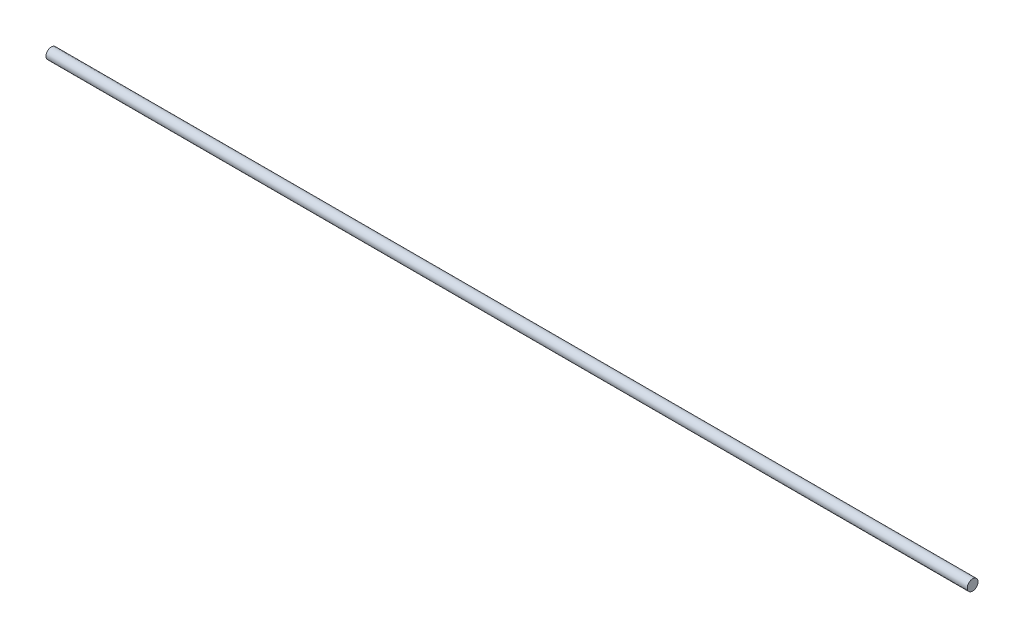
ISO-10303-21;
HEADER;
FILE_DESCRIPTION(('STEP AP214'),'2;1');
FILE_NAME('part.step','',(''),(''),'','','');
FILE_SCHEMA(('AUTOMOTIVE_DESIGN { 1 0 10303 214 1 1 1 1 }'));
ENDSEC;
DATA;
#1=APPLICATION_CONTEXT('core data for automotive mechanical design processes');
#2=APPLICATION_PROTOCOL_DEFINITION('international standard','automotive_design',2000,#1);
#3=PRODUCT_CONTEXT('',#1,'mechanical');
#4=PRODUCT('Part','Part','',(#3));
#5=PRODUCT_RELATED_PRODUCT_CATEGORY('part','',(#4));
#6=PRODUCT_DEFINITION_FORMATION('','',#4);
#7=PRODUCT_DEFINITION_CONTEXT('part definition',#1,'design');
#8=PRODUCT_DEFINITION('design','',#6,#7);
#9=PRODUCT_DEFINITION_SHAPE('','',#8);
#10=(LENGTH_UNIT() NAMED_UNIT(*) SI_UNIT(.MILLI.,.METRE.));
#11=(NAMED_UNIT(*) PLANE_ANGLE_UNIT() SI_UNIT($,.RADIAN.));
#12=(NAMED_UNIT(*) SI_UNIT($,.STERADIAN.) SOLID_ANGLE_UNIT());
#13=UNCERTAINTY_MEASURE_WITH_UNIT(LENGTH_MEASURE(1.E-05),#10,'distance_accuracy_value','');
#14=(GEOMETRIC_REPRESENTATION_CONTEXT(3) GLOBAL_UNCERTAINTY_ASSIGNED_CONTEXT((#13)) GLOBAL_UNIT_ASSIGNED_CONTEXT((#10,
#11,#12)) REPRESENTATION_CONTEXT('',''));
#15=CARTESIAN_POINT('',(0.,0.,0.));
#16=DIRECTION('',(0.,0.,1.));
#17=DIRECTION('',(1.,0.,0.));
#18=AXIS2_PLACEMENT_3D('',#15,#16,#17);
#19=CARTESIAN_POINT('',(152.4,0.,0.));
#20=DIRECTION('',(-1.,0.,0.));
#21=DIRECTION('',(0.,0.,1.));
#22=AXIS2_PLACEMENT_3D('',#19,#20,#21);
#23=CYLINDRICAL_SURFACE('',#22,1.778);
#24=CARTESIAN_POINT('',(152.4,0.,0.));
#25=DIRECTION('',(1.,0.,0.));
#26=DIRECTION('',(0.,0.,-1.));
#27=AXIS2_PLACEMENT_3D('',#24,#25,#26);
#28=CIRCLE('',#27,1.778);
#29=CARTESIAN_POINT('',(152.4,0.,-1.778));
#30=VERTEX_POINT('',#29);
#31=EDGE_CURVE('E10',#30,#30,#28,.T.);
#32=ORIENTED_EDGE('',*,*,#31,.F.);
#33=EDGE_LOOP('',(#32));
#34=FACE_BOUND('',#33,.T.);
#35=CARTESIAN_POINT('',(-152.4,0.,0.));
#36=DIRECTION('',(1.,0.,0.));
#37=DIRECTION('',(0.,0.,-1.));
#38=AXIS2_PLACEMENT_3D('',#35,#36,#37);
#39=CIRCLE('',#38,1.778);
#40=CARTESIAN_POINT('',(-152.4,0.,-1.778));
#41=VERTEX_POINT('',#40);
#42=EDGE_CURVE('E34',#41,#41,#39,.T.);
#43=ORIENTED_EDGE('',*,*,#42,.T.);
#44=EDGE_LOOP('',(#43));
#45=FACE_BOUND('',#44,.T.);
#46=ADVANCED_FACE('F31',(#34,#45),#23,.T.);
#47=CARTESIAN_POINT('',(152.4,0.,0.));
#48=DIRECTION('',(1.,0.,0.));
#49=DIRECTION('',(0.,0.,-1.));
#50=AXIS2_PLACEMENT_3D('',#47,#48,#49);
#51=PLANE('',#50);
#52=ORIENTED_EDGE('',*,*,#31,.T.);
#53=EDGE_LOOP('',(#52));
#54=FACE_BOUND('',#53,.T.);
#55=ADVANCED_FACE('F46',(#54),#51,.T.);
#56=CARTESIAN_POINT('',(-152.4,0.,0.));
#57=DIRECTION('',(1.,0.,0.));
#58=DIRECTION('',(0.,0.,-1.));
#59=AXIS2_PLACEMENT_3D('',#56,#57,#58);
#60=PLANE('',#59);
#61=ORIENTED_EDGE('',*,*,#42,.F.);
#62=EDGE_LOOP('',(#61));
#63=FACE_BOUND('',#62,.T.);
#64=ADVANCED_FACE('F44',(#63),#60,.F.);
#65=CLOSED_SHELL('',(#46,#55,#64));
#66=MANIFOLD_SOLID_BREP('B2',#65);
#67=ADVANCED_BREP_SHAPE_REPRESENTATION('',(#18,#66),#14);
#68=SHAPE_DEFINITION_REPRESENTATION(#9,#67);
ENDSEC;
END-ISO-10303-21;
